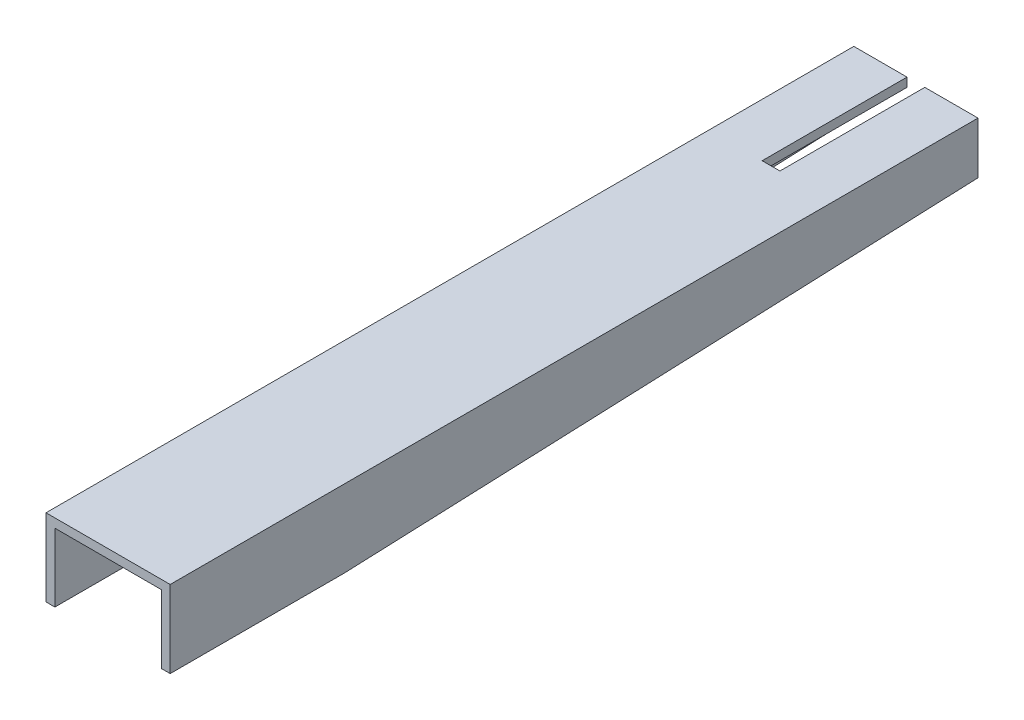
ISO-10303-21;
HEADER;
FILE_DESCRIPTION(('STEP AP214'),'2;1');
FILE_NAME('part.step','',(''),(''),'','','');
FILE_SCHEMA(('AUTOMOTIVE_DESIGN { 1 0 10303 214 1 1 1 1 }'));
ENDSEC;
DATA;
#1=APPLICATION_CONTEXT('core data for automotive mechanical design processes');
#2=APPLICATION_PROTOCOL_DEFINITION('international standard','automotive_design',2000,#1);
#3=PRODUCT_CONTEXT('',#1,'mechanical');
#4=PRODUCT('Part','Part','',(#3));
#5=PRODUCT_RELATED_PRODUCT_CATEGORY('part','',(#4));
#6=PRODUCT_DEFINITION_FORMATION('','',#4);
#7=PRODUCT_DEFINITION_CONTEXT('part definition',#1,'design');
#8=PRODUCT_DEFINITION('design','',#6,#7);
#9=PRODUCT_DEFINITION_SHAPE('','',#8);
#10=(LENGTH_UNIT() NAMED_UNIT(*) SI_UNIT(.MILLI.,.METRE.));
#11=(NAMED_UNIT(*) PLANE_ANGLE_UNIT() SI_UNIT($,.RADIAN.));
#12=(NAMED_UNIT(*) SI_UNIT($,.STERADIAN.) SOLID_ANGLE_UNIT());
#13=UNCERTAINTY_MEASURE_WITH_UNIT(LENGTH_MEASURE(1.E-05),#10,'distance_accuracy_value','');
#14=(GEOMETRIC_REPRESENTATION_CONTEXT(3) GLOBAL_UNCERTAINTY_ASSIGNED_CONTEXT((#13)) GLOBAL_UNIT_ASSIGNED_CONTEXT((#10,
#11,#12)) REPRESENTATION_CONTEXT('',''));
#15=CARTESIAN_POINT('',(0.,0.,0.));
#16=DIRECTION('',(0.,0.,1.));
#17=DIRECTION('',(1.,0.,0.));
#18=AXIS2_PLACEMENT_3D('',#15,#16,#17);
#19=CARTESIAN_POINT('',(0.,0.,0.));
#20=DIRECTION('',(0.,0.,1.));
#21=DIRECTION('',(1.,0.,0.));
#22=AXIS2_PLACEMENT_3D('',#19,#20,#21);
#23=PLANE('',#22);
#24=DIRECTION('',(-1.,0.,0.));
#25=VECTOR('',#24,1.);
#26=CARTESIAN_POINT('',(30.,25.,0.));
#27=LINE('',#26,#25);
#28=CARTESIAN_POINT('',(-4.3,25.,0.));
#29=VERTEX_POINT('',#28);
#30=CARTESIAN_POINT('',(-30.,25.,0.));
#31=VERTEX_POINT('',#30);
#32=EDGE_CURVE('E91',#29,#31,#27,.T.);
#33=ORIENTED_EDGE('',*,*,#32,.F.);
#34=DIRECTION('',(0.,-1.,0.));
#35=VECTOR('',#34,1.);
#36=CARTESIAN_POINT('',(-4.3,0.,0.));
#37=LINE('',#36,#35);
#38=CARTESIAN_POINT('',(-4.3,20.7,0.));
#39=VERTEX_POINT('',#38);
#40=EDGE_CURVE('E11',#29,#39,#37,.T.);
#41=ORIENTED_EDGE('',*,*,#40,.T.);
#42=DIRECTION('',(1.,0.,0.));
#43=VECTOR('',#42,1.);
#44=CARTESIAN_POINT('',(-25.7,20.7,0.));
#45=LINE('',#44,#43);
#46=CARTESIAN_POINT('',(-25.7,20.7,0.));
#47=VERTEX_POINT('',#46);
#48=EDGE_CURVE('E232',#47,#39,#45,.T.);
#49=ORIENTED_EDGE('',*,*,#48,.F.);
#50=DIRECTION('',(0.,1.,0.));
#51=VECTOR('',#50,1.);
#52=CARTESIAN_POINT('',(-25.7,0.,0.));
#53=LINE('',#52,#51);
#54=CARTESIAN_POINT('',(-25.7,0.,0.));
#55=VERTEX_POINT('',#54);
#56=EDGE_CURVE('E229',#55,#47,#53,.T.);
#57=ORIENTED_EDGE('',*,*,#56,.F.);
#58=DIRECTION('',(1.,0.,0.));
#59=VECTOR('',#58,1.);
#60=CARTESIAN_POINT('',(-30.,0.,0.));
#61=LINE('',#60,#59);
#62=CARTESIAN_POINT('',(-30.,0.,0.));
#63=VERTEX_POINT('',#62);
#64=EDGE_CURVE('E226',#63,#55,#61,.T.);
#65=ORIENTED_EDGE('',*,*,#64,.F.);
#66=DIRECTION('',(0.,-1.,0.));
#67=VECTOR('',#66,1.);
#68=CARTESIAN_POINT('',(-30.,25.,0.));
#69=LINE('',#68,#67);
#70=EDGE_CURVE('E210',#31,#63,#69,.T.);
#71=ORIENTED_EDGE('',*,*,#70,.F.);
#72=EDGE_LOOP('',(#33,#41,#49,#57,#65,#71));
#73=FACE_BOUND('',#72,.T.);
#74=ADVANCED_FACE('F40',(#73),#23,.F.);
#75=CARTESIAN_POINT('',(-30.,25.,390.3));
#76=DIRECTION('',(1.,0.,0.));
#77=DIRECTION('',(0.,0.,-1.));
#78=AXIS2_PLACEMENT_3D('',#75,#76,#77);
#79=PLANE('',#78);
#80=ORIENTED_EDGE('',*,*,#70,.T.);
#81=DIRECTION('',(0.,0.040196245461984,-0.999191804335264));
#82=VECTOR('',#81,1.);
#83=CARTESIAN_POINT('',(-30.,-12.31,306.));
#84=LINE('',#83,#82);
#85=CARTESIAN_POINT('',(-30.,-12.31,306.));
#86=VERTEX_POINT('',#85);
#87=EDGE_CURVE('E181',#86,#63,#84,.T.);
#88=ORIENTED_EDGE('',*,*,#87,.F.);
#89=DIRECTION('',(0.,0.,-1.));
#90=VECTOR('',#89,1.);
#91=CARTESIAN_POINT('',(-30.,-12.31,390.3));
#92=LINE('',#91,#90);
#93=CARTESIAN_POINT('',(-30.,-12.31,390.3));
#94=VERTEX_POINT('',#93);
#95=EDGE_CURVE('E176',#94,#86,#92,.T.);
#96=ORIENTED_EDGE('',*,*,#95,.F.);
#97=DIRECTION('',(0.,-1.,0.));
#98=VECTOR('',#97,1.);
#99=CARTESIAN_POINT('',(-30.,25.,390.3));
#100=LINE('',#99,#98);
#101=CARTESIAN_POINT('',(-30.,25.,390.3));
#102=VERTEX_POINT('',#101);
#103=EDGE_CURVE('E212',#102,#94,#100,.T.);
#104=ORIENTED_EDGE('',*,*,#103,.F.);
#105=DIRECTION('',(0.,0.,-1.));
#106=VECTOR('',#105,1.);
#107=CARTESIAN_POINT('',(-30.,25.,390.3));
#108=LINE('',#107,#106);
#109=EDGE_CURVE('E223',#102,#31,#108,.T.);
#110=ORIENTED_EDGE('',*,*,#109,.T.);
#111=EDGE_LOOP('',(#80,#88,#96,#104,#110));
#112=FACE_BOUND('',#111,.T.);
#113=ADVANCED_FACE('F42',(#112),#79,.F.);
#114=CARTESIAN_POINT('',(-25.7,0.,390.3));
#115=DIRECTION('',(-1.,0.,0.));
#116=DIRECTION('',(0.,0.,1.));
#117=AXIS2_PLACEMENT_3D('',#114,#115,#116);
#118=PLANE('',#117);
#119=ORIENTED_EDGE('',*,*,#56,.T.);
#120=DIRECTION('',(0.,0.,-1.));
#121=VECTOR('',#120,1.);
#122=CARTESIAN_POINT('',(-25.7,20.7,390.3));
#123=LINE('',#122,#121);
#124=CARTESIAN_POINT('',(-25.7,20.7,390.3));
#125=VERTEX_POINT('',#124);
#126=EDGE_CURVE('E250',#125,#47,#123,.T.);
#127=ORIENTED_EDGE('',*,*,#126,.F.);
#128=DIRECTION('',(0.,1.,0.));
#129=VECTOR('',#128,1.);
#130=CARTESIAN_POINT('',(-25.7,0.,390.3));
#131=LINE('',#130,#129);
#132=CARTESIAN_POINT('',(-25.7,-12.31,390.3));
#133=VERTEX_POINT('',#132);
#134=EDGE_CURVE('E98',#133,#125,#131,.T.);
#135=ORIENTED_EDGE('',*,*,#134,.F.);
#136=DIRECTION('',(0.,0.,-1.));
#137=VECTOR('',#136,1.);
#138=CARTESIAN_POINT('',(-25.7,-12.31,390.3));
#139=LINE('',#138,#137);
#140=CARTESIAN_POINT('',(-25.7,-12.31,306.));
#141=VERTEX_POINT('',#140);
#142=EDGE_CURVE('E177',#133,#141,#139,.T.);
#143=ORIENTED_EDGE('',*,*,#142,.T.);
#144=DIRECTION('',(0.,0.040196245461984,-0.999191804335264));
#145=VECTOR('',#144,1.);
#146=CARTESIAN_POINT('',(-25.7,-12.31,306.));
#147=LINE('',#146,#145);
#148=EDGE_CURVE('E180',#141,#55,#147,.T.);
#149=ORIENTED_EDGE('',*,*,#148,.T.);
#150=EDGE_LOOP('',(#119,#127,#135,#143,#149));
#151=FACE_BOUND('',#150,.T.);
#152=ADVANCED_FACE('F292',(#151),#118,.F.);
#153=CARTESIAN_POINT('',(-25.7,20.7,390.3));
#154=DIRECTION('',(0.,1.,0.));
#155=DIRECTION('',(0.,0.,1.));
#156=AXIS2_PLACEMENT_3D('',#153,#154,#155);
#157=PLANE('',#156);
#158=ORIENTED_EDGE('',*,*,#48,.T.);
#159=DIRECTION('',(0.,0.,1.));
#160=VECTOR('',#159,1.);
#161=CARTESIAN_POINT('',(-4.29999999999995,20.7,390.3));
#162=LINE('',#161,#160);
#163=CARTESIAN_POINT('',(-4.29999999999999,20.7,70.));
#164=VERTEX_POINT('',#163);
#165=EDGE_CURVE('E173',#39,#164,#162,.T.);
#166=ORIENTED_EDGE('',*,*,#165,.T.);
#167=DIRECTION('',(1.,0.,0.));
#168=VECTOR('',#167,1.);
#169=CARTESIAN_POINT('',(-25.7,20.7,70.));
#170=LINE('',#169,#168);
#171=CARTESIAN_POINT('',(4.29999999999999,20.7,70.));
#172=VERTEX_POINT('',#171);
#173=EDGE_CURVE('E156',#164,#172,#170,.T.);
#174=ORIENTED_EDGE('',*,*,#173,.T.);
#175=DIRECTION('',(0.,0.,-1.));
#176=VECTOR('',#175,1.);
#177=CARTESIAN_POINT('',(4.29999999999995,20.7,390.3));
#178=LINE('',#177,#176);
#179=CARTESIAN_POINT('',(4.3,20.7,0.));
#180=VERTEX_POINT('',#179);
#181=EDGE_CURVE('E169',#172,#180,#178,.T.);
#182=ORIENTED_EDGE('',*,*,#181,.T.);
#183=CARTESIAN_POINT('',(25.7,20.7,0.));
#184=VERTEX_POINT('',#183);
#185=EDGE_CURVE('E231',#180,#184,#45,.T.);
#186=ORIENTED_EDGE('',*,*,#185,.T.);
#187=DIRECTION('',(0.,0.,-1.));
#188=VECTOR('',#187,1.);
#189=CARTESIAN_POINT('',(25.7,20.7,390.3));
#190=LINE('',#189,#188);
#191=CARTESIAN_POINT('',(25.7,20.7,390.3));
#192=VERTEX_POINT('',#191);
#193=EDGE_CURVE('E247',#192,#184,#190,.T.);
#194=ORIENTED_EDGE('',*,*,#193,.F.);
#195=DIRECTION('',(1.,0.,0.));
#196=VECTOR('',#195,1.);
#197=CARTESIAN_POINT('',(-25.7,20.7,390.3));
#198=LINE('',#197,#196);
#199=EDGE_CURVE('E216',#125,#192,#198,.T.);
#200=ORIENTED_EDGE('',*,*,#199,.F.);
#201=ORIENTED_EDGE('',*,*,#126,.T.);
#202=EDGE_LOOP('',(#158,#166,#174,#182,#186,#194,#200,#201));
#203=FACE_BOUND('',#202,.T.);
#204=ADVANCED_FACE('F277',(#203),#157,.F.);
#205=CARTESIAN_POINT('',(25.7,20.7,390.3));
#206=DIRECTION('',(1.,0.,0.));
#207=DIRECTION('',(0.,0.,-1.));
#208=AXIS2_PLACEMENT_3D('',#205,#206,#207);
#209=PLANE('',#208);
#210=DIRECTION('',(0.,-1.,0.));
#211=VECTOR('',#210,1.);
#212=CARTESIAN_POINT('',(25.7,20.7,0.));
#213=LINE('',#212,#211);
#214=CARTESIAN_POINT('',(25.7,0.,0.));
#215=VERTEX_POINT('',#214);
#216=EDGE_CURVE('E235',#184,#215,#213,.T.);
#217=ORIENTED_EDGE('',*,*,#216,.T.);
#218=DIRECTION('',(0.,0.040196245461984,-0.999191804335264));
#219=VECTOR('',#218,1.);
#220=CARTESIAN_POINT('',(25.7,-12.31,306.));
#221=LINE('',#220,#219);
#222=CARTESIAN_POINT('',(25.7,-12.31,306.));
#223=VERTEX_POINT('',#222);
#224=EDGE_CURVE('E198',#223,#215,#221,.T.);
#225=ORIENTED_EDGE('',*,*,#224,.F.);
#226=DIRECTION('',(0.,0.,-1.));
#227=VECTOR('',#226,1.);
#228=CARTESIAN_POINT('',(25.7,-12.31,390.3));
#229=LINE('',#228,#227);
#230=CARTESIAN_POINT('',(25.7,-12.31,390.3));
#231=VERTEX_POINT('',#230);
#232=EDGE_CURVE('E195',#231,#223,#229,.T.);
#233=ORIENTED_EDGE('',*,*,#232,.F.);
#234=DIRECTION('',(0.,-1.,0.));
#235=VECTOR('',#234,1.);
#236=CARTESIAN_POINT('',(25.7,20.7,390.3));
#237=LINE('',#236,#235);
#238=EDGE_CURVE('E218',#192,#231,#237,.T.);
#239=ORIENTED_EDGE('',*,*,#238,.F.);
#240=ORIENTED_EDGE('',*,*,#193,.T.);
#241=EDGE_LOOP('',(#217,#225,#233,#239,#240));
#242=FACE_BOUND('',#241,.T.);
#243=ADVANCED_FACE('F267',(#242),#209,.F.);
#244=CARTESIAN_POINT('',(30.,0.,390.3));
#245=DIRECTION('',(-1.,0.,0.));
#246=DIRECTION('',(0.,0.,1.));
#247=AXIS2_PLACEMENT_3D('',#244,#245,#246);
#248=PLANE('',#247);
#249=DIRECTION('',(0.,1.,0.));
#250=VECTOR('',#249,1.);
#251=CARTESIAN_POINT('',(30.,0.,0.));
#252=LINE('',#251,#250);
#253=CARTESIAN_POINT('',(30.,0.,0.));
#254=VERTEX_POINT('',#253);
#255=CARTESIAN_POINT('',(30.,25.,0.));
#256=VERTEX_POINT('',#255);
#257=EDGE_CURVE('E240',#254,#256,#252,.T.);
#258=ORIENTED_EDGE('',*,*,#257,.T.);
#259=DIRECTION('',(0.,0.,-1.));
#260=VECTOR('',#259,1.);
#261=CARTESIAN_POINT('',(30.,25.,390.3));
#262=LINE('',#261,#260);
#263=CARTESIAN_POINT('',(30.,25.,390.3));
#264=VERTEX_POINT('',#263);
#265=EDGE_CURVE('E244',#264,#256,#262,.T.);
#266=ORIENTED_EDGE('',*,*,#265,.F.);
#267=DIRECTION('',(0.,1.,0.));
#268=VECTOR('',#267,1.);
#269=CARTESIAN_POINT('',(30.,0.,390.3));
#270=LINE('',#269,#268);
#271=CARTESIAN_POINT('',(30.,-12.31,390.3));
#272=VERTEX_POINT('',#271);
#273=EDGE_CURVE('E220',#272,#264,#270,.T.);
#274=ORIENTED_EDGE('',*,*,#273,.F.);
#275=DIRECTION('',(0.,0.,-1.));
#276=VECTOR('',#275,1.);
#277=CARTESIAN_POINT('',(30.,-12.31,390.3));
#278=LINE('',#277,#276);
#279=CARTESIAN_POINT('',(30.,-12.31,306.));
#280=VERTEX_POINT('',#279);
#281=EDGE_CURVE('E192',#272,#280,#278,.T.);
#282=ORIENTED_EDGE('',*,*,#281,.T.);
#283=DIRECTION('',(0.,0.040196245461984,-0.999191804335264));
#284=VECTOR('',#283,1.);
#285=CARTESIAN_POINT('',(30.,-12.31,306.));
#286=LINE('',#285,#284);
#287=EDGE_CURVE('E199',#280,#254,#286,.T.);
#288=ORIENTED_EDGE('',*,*,#287,.T.);
#289=EDGE_LOOP('',(#258,#266,#274,#282,#288));
#290=FACE_BOUND('',#289,.T.);
#291=ADVANCED_FACE('F259',(#290),#248,.F.);
#292=CARTESIAN_POINT('',(30.,25.,390.3));
#293=DIRECTION('',(0.,-1.,0.));
#294=DIRECTION('',(0.,0.,-1.));
#295=AXIS2_PLACEMENT_3D('',#292,#293,#294);
#296=PLANE('',#295);
#297=DIRECTION('',(1.,0.,0.));
#298=VECTOR('',#297,1.);
#299=CARTESIAN_POINT('',(-4.29999999999999,25.,70.));
#300=LINE('',#299,#298);
#301=CARTESIAN_POINT('',(-4.29999999999999,25.,70.));
#302=VERTEX_POINT('',#301);
#303=CARTESIAN_POINT('',(4.29999999999999,25.,70.));
#304=VERTEX_POINT('',#303);
#305=EDGE_CURVE('E154',#302,#304,#300,.T.);
#306=ORIENTED_EDGE('',*,*,#305,.F.);
#307=DIRECTION('',(0.,0.,1.));
#308=VECTOR('',#307,1.);
#309=CARTESIAN_POINT('',(-4.3,25.,0.));
#310=LINE('',#309,#308);
#311=EDGE_CURVE('E161',#29,#302,#310,.T.);
#312=ORIENTED_EDGE('',*,*,#311,.F.);
#313=ORIENTED_EDGE('',*,*,#32,.T.);
#314=ORIENTED_EDGE('',*,*,#109,.F.);
#315=DIRECTION('',(-1.,0.,0.));
#316=VECTOR('',#315,1.);
#317=CARTESIAN_POINT('',(30.,25.,390.3));
#318=LINE('',#317,#316);
#319=EDGE_CURVE('E64',#264,#102,#318,.T.);
#320=ORIENTED_EDGE('',*,*,#319,.F.);
#321=ORIENTED_EDGE('',*,*,#265,.T.);
#322=CARTESIAN_POINT('',(4.3,25.,0.));
#323=VERTEX_POINT('',#322);
#324=EDGE_CURVE('E214',#256,#323,#27,.T.);
#325=ORIENTED_EDGE('',*,*,#324,.T.);
#326=DIRECTION('',(0.,0.,-1.));
#327=VECTOR('',#326,1.);
#328=CARTESIAN_POINT('',(4.3,25.,0.));
#329=LINE('',#328,#327);
#330=EDGE_CURVE('E55',#304,#323,#329,.T.);
#331=ORIENTED_EDGE('',*,*,#330,.F.);
#332=EDGE_LOOP('',(#306,#312,#313,#314,#320,#321,#325,#331));
#333=FACE_BOUND('',#332,.T.);
#334=ADVANCED_FACE('F164',(#333),#296,.F.);
#335=CARTESIAN_POINT('',(0.,0.,390.3));
#336=DIRECTION('',(0.,0.,1.));
#337=DIRECTION('',(1.,0.,0.));
#338=AXIS2_PLACEMENT_3D('',#335,#336,#337);
#339=PLANE('',#338);
#340=ORIENTED_EDGE('',*,*,#103,.T.);
#341=DIRECTION('',(-1.,0.,0.));
#342=VECTOR('',#341,1.);
#343=CARTESIAN_POINT('',(-25.7,-12.31,390.3));
#344=LINE('',#343,#342);
#345=EDGE_CURVE('E184',#133,#94,#344,.T.);
#346=ORIENTED_EDGE('',*,*,#345,.F.);
#347=ORIENTED_EDGE('',*,*,#134,.T.);
#348=ORIENTED_EDGE('',*,*,#199,.T.);
#349=ORIENTED_EDGE('',*,*,#238,.T.);
#350=DIRECTION('',(1.,0.,0.));
#351=VECTOR('',#350,1.);
#352=CARTESIAN_POINT('',(25.7,-12.31,390.3));
#353=LINE('',#352,#351);
#354=EDGE_CURVE('E207',#231,#272,#353,.T.);
#355=ORIENTED_EDGE('',*,*,#354,.T.);
#356=ORIENTED_EDGE('',*,*,#273,.T.);
#357=ORIENTED_EDGE('',*,*,#319,.T.);
#358=EDGE_LOOP('',(#340,#346,#347,#348,#349,#355,#356,#357));
#359=FACE_BOUND('',#358,.T.);
#360=ADVANCED_FACE('F273',(#359),#339,.T.);
#361=ORIENTED_EDGE('',*,*,#185,.F.);
#362=DIRECTION('',(0.,1.,0.));
#363=VECTOR('',#362,1.);
#364=CARTESIAN_POINT('',(4.3,0.,0.));
#365=LINE('',#364,#363);
#366=EDGE_CURVE('E48',#180,#323,#365,.T.);
#367=ORIENTED_EDGE('',*,*,#366,.T.);
#368=ORIENTED_EDGE('',*,*,#324,.F.);
#369=ORIENTED_EDGE('',*,*,#257,.F.);
#370=DIRECTION('',(1.,0.,0.));
#371=VECTOR('',#370,1.);
#372=CARTESIAN_POINT('',(25.7,0.,0.));
#373=LINE('',#372,#371);
#374=EDGE_CURVE('E237',#215,#254,#373,.T.);
#375=ORIENTED_EDGE('',*,*,#374,.F.);
#376=ORIENTED_EDGE('',*,*,#216,.F.);
#377=EDGE_LOOP('',(#361,#367,#368,#369,#375,#376));
#378=FACE_BOUND('',#377,.T.);
#379=ADVANCED_FACE('F255',(#378),#23,.F.);
#380=CARTESIAN_POINT('',(25.7,-12.31,390.3));
#381=DIRECTION('',(0.,-1.,0.));
#382=DIRECTION('',(1.,0.,0.));
#383=AXIS2_PLACEMENT_3D('',#380,#381,#382);
#384=PLANE('',#383);
#385=ORIENTED_EDGE('',*,*,#281,.F.);
#386=ORIENTED_EDGE('',*,*,#354,.F.);
#387=ORIENTED_EDGE('',*,*,#232,.T.);
#388=DIRECTION('',(1.,0.,0.));
#389=VECTOR('',#388,1.);
#390=CARTESIAN_POINT('',(25.7,-12.31,306.));
#391=LINE('',#390,#389);
#392=EDGE_CURVE('E202',#223,#280,#391,.T.);
#393=ORIENTED_EDGE('',*,*,#392,.T.);
#394=EDGE_LOOP('',(#385,#386,#387,#393));
#395=FACE_BOUND('',#394,.T.);
#396=ADVANCED_FACE('F272',(#395),#384,.T.);
#397=CARTESIAN_POINT('',(25.7,-12.31,306.));
#398=DIRECTION('',(0.,-0.999191804335264,-0.040196245461984));
#399=DIRECTION('',(0.,0.040196245461984,-0.999191804335264));
#400=AXIS2_PLACEMENT_3D('',#397,#398,#399);
#401=PLANE('',#400);
#402=ORIENTED_EDGE('',*,*,#287,.F.);
#403=ORIENTED_EDGE('',*,*,#392,.F.);
#404=ORIENTED_EDGE('',*,*,#224,.T.);
#405=ORIENTED_EDGE('',*,*,#374,.T.);
#406=EDGE_LOOP('',(#402,#403,#404,#405));
#407=FACE_BOUND('',#406,.T.);
#408=ADVANCED_FACE('F263',(#407),#401,.T.);
#409=CARTESIAN_POINT('',(-25.7,-12.31,390.3));
#410=DIRECTION('',(0.,1.,0.));
#411=DIRECTION('',(-1.,0.,0.));
#412=AXIS2_PLACEMENT_3D('',#409,#410,#411);
#413=PLANE('',#412);
#414=ORIENTED_EDGE('',*,*,#95,.T.);
#415=DIRECTION('',(-1.,0.,0.));
#416=VECTOR('',#415,1.);
#417=CARTESIAN_POINT('',(-25.7,-12.31,306.));
#418=LINE('',#417,#416);
#419=EDGE_CURVE('E189',#141,#86,#418,.T.);
#420=ORIENTED_EDGE('',*,*,#419,.F.);
#421=ORIENTED_EDGE('',*,*,#142,.F.);
#422=ORIENTED_EDGE('',*,*,#345,.T.);
#423=EDGE_LOOP('',(#414,#420,#421,#422));
#424=FACE_BOUND('',#423,.T.);
#425=ADVANCED_FACE('F308',(#424),#413,.F.);
#426=CARTESIAN_POINT('',(-25.7,-12.31,306.));
#427=DIRECTION('',(0.,0.999191804335264,0.040196245461984));
#428=DIRECTION('',(0.,-0.040196245461984,0.999191804335264));
#429=AXIS2_PLACEMENT_3D('',#426,#427,#428);
#430=PLANE('',#429);
#431=ORIENTED_EDGE('',*,*,#87,.T.);
#432=ORIENTED_EDGE('',*,*,#64,.T.);
#433=ORIENTED_EDGE('',*,*,#148,.F.);
#434=ORIENTED_EDGE('',*,*,#419,.T.);
#435=EDGE_LOOP('',(#431,#432,#433,#434));
#436=FACE_BOUND('',#435,.T.);
#437=ADVANCED_FACE('F311',(#436),#430,.F.);
#438=CARTESIAN_POINT('',(-4.29999999999999,15.,70.));
#439=DIRECTION('',(0.,0.,1.));
#440=DIRECTION('',(1.,0.,0.));
#441=AXIS2_PLACEMENT_3D('',#438,#439,#440);
#442=PLANE('',#441);
#443=DIRECTION('',(0.,1.,0.));
#444=VECTOR('',#443,1.);
#445=CARTESIAN_POINT('',(-4.29999999999999,15.,70.));
#446=LINE('',#445,#444);
#447=EDGE_CURVE('E149',#164,#302,#446,.T.);
#448=ORIENTED_EDGE('',*,*,#447,.T.);
#449=ORIENTED_EDGE('',*,*,#305,.T.);
#450=DIRECTION('',(0.,1.,0.));
#451=VECTOR('',#450,1.);
#452=CARTESIAN_POINT('',(4.29999999999999,15.,70.));
#453=LINE('',#452,#451);
#454=EDGE_CURVE('E159',#172,#304,#453,.T.);
#455=ORIENTED_EDGE('',*,*,#454,.F.);
#456=ORIENTED_EDGE('',*,*,#173,.F.);
#457=EDGE_LOOP('',(#448,#449,#455,#456));
#458=FACE_BOUND('',#457,.T.);
#459=ADVANCED_FACE('F151',(#458),#442,.F.);
#460=CARTESIAN_POINT('',(-4.3,15.,0.));
#461=DIRECTION('',(-1.,0.,0.));
#462=DIRECTION('',(0.,0.,1.));
#463=AXIS2_PLACEMENT_3D('',#460,#461,#462);
#464=PLANE('',#463);
#465=ORIENTED_EDGE('',*,*,#40,.F.);
#466=ORIENTED_EDGE('',*,*,#311,.T.);
#467=ORIENTED_EDGE('',*,*,#447,.F.);
#468=ORIENTED_EDGE('',*,*,#165,.F.);
#469=EDGE_LOOP('',(#465,#466,#467,#468));
#470=FACE_BOUND('',#469,.T.);
#471=ADVANCED_FACE('F162',(#470),#464,.F.);
#472=CARTESIAN_POINT('',(4.3,15.,0.));
#473=DIRECTION('',(1.,0.,0.));
#474=DIRECTION('',(0.,0.,-1.));
#475=AXIS2_PLACEMENT_3D('',#472,#473,#474);
#476=PLANE('',#475);
#477=ORIENTED_EDGE('',*,*,#454,.T.);
#478=ORIENTED_EDGE('',*,*,#330,.T.);
#479=ORIENTED_EDGE('',*,*,#366,.F.);
#480=ORIENTED_EDGE('',*,*,#181,.F.);
#481=EDGE_LOOP('',(#477,#478,#479,#480));
#482=FACE_BOUND('',#481,.T.);
#483=ADVANCED_FACE('F278',(#482),#476,.F.);
#484=CLOSED_SHELL('',(#74,#113,#152,#204,#243,#291,#334,#360,#379,#396,#408,#425,#437,#459,#471,#483));
#485=MANIFOLD_SOLID_BREP('B2',#484);
#486=ADVANCED_BREP_SHAPE_REPRESENTATION('',(#18,#485),#14);
#487=SHAPE_DEFINITION_REPRESENTATION(#9,#486);
ENDSEC;
END-ISO-10303-21;
